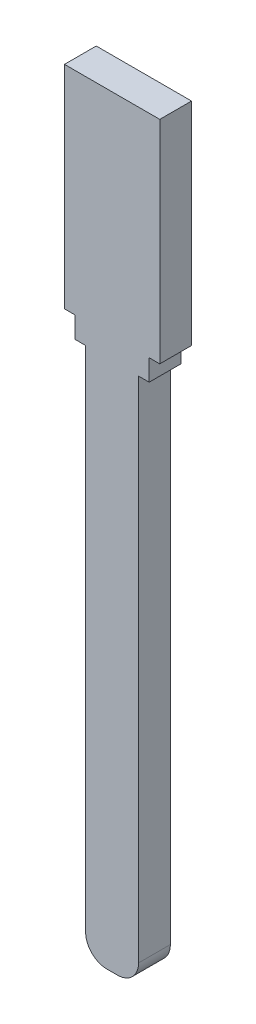
ISO-10303-21;
HEADER;
FILE_DESCRIPTION(('STEP AP214'),'2;1');
FILE_NAME('part.step','',(''),(''),'','','');
FILE_SCHEMA(('AUTOMOTIVE_DESIGN { 1 0 10303 214 1 1 1 1 }'));
ENDSEC;
DATA;
#1=APPLICATION_CONTEXT('core data for automotive mechanical design processes');
#2=APPLICATION_PROTOCOL_DEFINITION('international standard','automotive_design',2000,#1);
#3=PRODUCT_CONTEXT('',#1,'mechanical');
#4=PRODUCT('Part','Part','',(#3));
#5=PRODUCT_RELATED_PRODUCT_CATEGORY('part','',(#4));
#6=PRODUCT_DEFINITION_FORMATION('','',#4);
#7=PRODUCT_DEFINITION_CONTEXT('part definition',#1,'design');
#8=PRODUCT_DEFINITION('design','',#6,#7);
#9=PRODUCT_DEFINITION_SHAPE('','',#8);
#10=(LENGTH_UNIT() NAMED_UNIT(*) SI_UNIT(.MILLI.,.METRE.));
#11=(NAMED_UNIT(*) PLANE_ANGLE_UNIT() SI_UNIT($,.RADIAN.));
#12=(NAMED_UNIT(*) SI_UNIT($,.STERADIAN.) SOLID_ANGLE_UNIT());
#13=UNCERTAINTY_MEASURE_WITH_UNIT(LENGTH_MEASURE(1.E-05),#10,'distance_accuracy_value','');
#14=(GEOMETRIC_REPRESENTATION_CONTEXT(3) GLOBAL_UNCERTAINTY_ASSIGNED_CONTEXT((#13)) GLOBAL_UNIT_ASSIGNED_CONTEXT((#10,
#11,#12)) REPRESENTATION_CONTEXT('',''));
#15=CARTESIAN_POINT('',(0.,0.,0.));
#16=DIRECTION('',(0.,0.,1.));
#17=DIRECTION('',(1.,0.,0.));
#18=AXIS2_PLACEMENT_3D('',#15,#16,#17);
#19=CARTESIAN_POINT('',(-40.4136113676577,-48.5,3.));
#20=DIRECTION('',(0.,0.,-1.));
#21=DIRECTION('',(-1.,0.,0.));
#22=AXIS2_PLACEMENT_3D('',#19,#20,#21);
#23=CYLINDRICAL_SURFACE('',#22,2.);
#24=CARTESIAN_POINT('',(-40.4136113676577,-48.5,0.));
#25=DIRECTION('',(0.,0.,1.));
#26=DIRECTION('',(1.,0.,0.));
#27=AXIS2_PLACEMENT_3D('',#24,#25,#26);
#28=CIRCLE('',#27,2.);
#29=CARTESIAN_POINT('',(-40.4136113676577,-50.5,0.));
#30=VERTEX_POINT('',#29);
#31=CARTESIAN_POINT('',(-38.4136113676577,-48.5,0.));
#32=VERTEX_POINT('',#31);
#33=EDGE_CURVE('E165',#30,#32,#28,.T.);
#34=ORIENTED_EDGE('',*,*,#33,.T.);
#35=DIRECTION('',(0.,0.,-1.));
#36=VECTOR('',#35,1.);
#37=CARTESIAN_POINT('',(-38.4136113676577,-48.5,3.));
#38=LINE('',#37,#36);
#39=CARTESIAN_POINT('',(-38.4136113676577,-48.5,3.));
#40=VERTEX_POINT('',#39);
#41=EDGE_CURVE('E11',#40,#32,#38,.T.);
#42=ORIENTED_EDGE('',*,*,#41,.F.);
#43=CARTESIAN_POINT('',(-40.4136113676577,-48.5,3.));
#44=DIRECTION('',(0.,0.,1.));
#45=DIRECTION('',(1.,0.,0.));
#46=AXIS2_PLACEMENT_3D('',#43,#44,#45);
#47=CIRCLE('',#46,2.);
#48=CARTESIAN_POINT('',(-40.4136113676577,-50.5,3.));
#49=VERTEX_POINT('',#48);
#50=EDGE_CURVE('E192',#49,#40,#47,.T.);
#51=ORIENTED_EDGE('',*,*,#50,.F.);
#52=DIRECTION('',(0.,0.,-1.));
#53=VECTOR('',#52,1.);
#54=CARTESIAN_POINT('',(-40.4136113676577,-50.5,3.));
#55=LINE('',#54,#53);
#56=EDGE_CURVE('E161',#49,#30,#55,.T.);
#57=ORIENTED_EDGE('',*,*,#56,.T.);
#58=EDGE_LOOP('',(#34,#42,#51,#57));
#59=FACE_BOUND('',#58,.T.);
#60=ADVANCED_FACE('F33',(#59),#23,.T.);
#61=CARTESIAN_POINT('',(-38.4136113676577,-0.499999999999997,3.));
#62=DIRECTION('',(-1.,0.,0.));
#63=DIRECTION('',(0.,0.,1.));
#64=AXIS2_PLACEMENT_3D('',#61,#62,#63);
#65=PLANE('',#64);
#66=DIRECTION('',(0.,1.,0.));
#67=VECTOR('',#66,1.);
#68=CARTESIAN_POINT('',(-38.4136113676577,-0.499999999999997,0.));
#69=LINE('',#68,#67);
#70=CARTESIAN_POINT('',(-38.4136113676577,-0.499999999999997,0.));
#71=VERTEX_POINT('',#70);
#72=EDGE_CURVE('E168',#32,#71,#69,.T.);
#73=ORIENTED_EDGE('',*,*,#72,.T.);
#74=DIRECTION('',(0.,0.,-1.));
#75=VECTOR('',#74,1.);
#76=CARTESIAN_POINT('',(-38.4136113676577,-0.499999999999997,3.));
#77=LINE('',#76,#75);
#78=CARTESIAN_POINT('',(-38.4136113676577,-0.499999999999997,3.));
#79=VERTEX_POINT('',#78);
#80=EDGE_CURVE('E41',#79,#71,#77,.T.);
#81=ORIENTED_EDGE('',*,*,#80,.F.);
#82=DIRECTION('',(0.,1.,0.));
#83=VECTOR('',#82,1.);
#84=CARTESIAN_POINT('',(-38.4136113676577,-0.499999999999997,3.));
#85=LINE('',#84,#83);
#86=EDGE_CURVE('E110',#40,#79,#85,.T.);
#87=ORIENTED_EDGE('',*,*,#86,.F.);
#88=ORIENTED_EDGE('',*,*,#41,.T.);
#89=EDGE_LOOP('',(#73,#81,#87,#88));
#90=FACE_BOUND('',#89,.T.);
#91=ADVANCED_FACE('F279',(#90),#65,.F.);
#92=CARTESIAN_POINT('',(-37.4136113676577,-0.499999999999997,3.));
#93=DIRECTION('',(0.,1.,0.));
#94=DIRECTION('',(0.,0.,1.));
#95=AXIS2_PLACEMENT_3D('',#92,#93,#94);
#96=PLANE('',#95);
#97=DIRECTION('',(1.,0.,0.));
#98=VECTOR('',#97,1.);
#99=CARTESIAN_POINT('',(-37.4136113676577,-0.499999999999997,0.));
#100=LINE('',#99,#98);
#101=CARTESIAN_POINT('',(-37.4136113676577,-0.499999999999997,0.));
#102=VERTEX_POINT('',#101);
#103=EDGE_CURVE('E170',#71,#102,#100,.T.);
#104=ORIENTED_EDGE('',*,*,#103,.T.);
#105=DIRECTION('',(0.,0.,-1.));
#106=VECTOR('',#105,1.);
#107=CARTESIAN_POINT('',(-37.4136113676577,-0.499999999999997,3.));
#108=LINE('',#107,#106);
#109=CARTESIAN_POINT('',(-37.4136113676577,-0.499999999999997,3.));
#110=VERTEX_POINT('',#109);
#111=EDGE_CURVE('E217',#110,#102,#108,.T.);
#112=ORIENTED_EDGE('',*,*,#111,.F.);
#113=DIRECTION('',(1.,0.,0.));
#114=VECTOR('',#113,1.);
#115=CARTESIAN_POINT('',(-37.4136113676577,-0.499999999999997,3.));
#116=LINE('',#115,#114);
#117=EDGE_CURVE('E225',#79,#110,#116,.T.);
#118=ORIENTED_EDGE('',*,*,#117,.F.);
#119=ORIENTED_EDGE('',*,*,#80,.T.);
#120=EDGE_LOOP('',(#104,#112,#118,#119));
#121=FACE_BOUND('',#120,.T.);
#122=ADVANCED_FACE('F223',(#121),#96,.F.);
#123=CARTESIAN_POINT('',(-37.4136113676577,1.5,3.));
#124=DIRECTION('',(-1.,0.,0.));
#125=DIRECTION('',(0.,0.,1.));
#126=AXIS2_PLACEMENT_3D('',#123,#124,#125);
#127=PLANE('',#126);
#128=DIRECTION('',(0.,1.,0.));
#129=VECTOR('',#128,1.);
#130=CARTESIAN_POINT('',(-37.4136113676577,1.5,0.));
#131=LINE('',#130,#129);
#132=CARTESIAN_POINT('',(-37.4136113676577,1.5,0.));
#133=VERTEX_POINT('',#132);
#134=EDGE_CURVE('E172',#102,#133,#131,.T.);
#135=ORIENTED_EDGE('',*,*,#134,.T.);
#136=DIRECTION('',(0.,0.,-1.));
#137=VECTOR('',#136,1.);
#138=CARTESIAN_POINT('',(-37.4136113676577,1.5,3.));
#139=LINE('',#138,#137);
#140=CARTESIAN_POINT('',(-37.4136113676577,1.5,3.));
#141=VERTEX_POINT('',#140);
#142=EDGE_CURVE('E214',#141,#133,#139,.T.);
#143=ORIENTED_EDGE('',*,*,#142,.F.);
#144=DIRECTION('',(0.,1.,0.));
#145=VECTOR('',#144,1.);
#146=CARTESIAN_POINT('',(-37.4136113676577,1.5,3.));
#147=LINE('',#146,#145);
#148=EDGE_CURVE('E242',#110,#141,#147,.T.);
#149=ORIENTED_EDGE('',*,*,#148,.F.);
#150=ORIENTED_EDGE('',*,*,#111,.T.);
#151=EDGE_LOOP('',(#135,#143,#149,#150));
#152=FACE_BOUND('',#151,.T.);
#153=ADVANCED_FACE('F233',(#152),#127,.F.);
#154=CARTESIAN_POINT('',(-36.4136113676577,1.5,3.));
#155=DIRECTION('',(0.,1.,0.));
#156=DIRECTION('',(0.,0.,1.));
#157=AXIS2_PLACEMENT_3D('',#154,#155,#156);
#158=PLANE('',#157);
#159=DIRECTION('',(1.,0.,0.));
#160=VECTOR('',#159,1.);
#161=CARTESIAN_POINT('',(-36.4136113676577,1.5,0.));
#162=LINE('',#161,#160);
#163=CARTESIAN_POINT('',(-36.4136113676577,1.5,0.));
#164=VERTEX_POINT('',#163);
#165=EDGE_CURVE('E174',#133,#164,#162,.T.);
#166=ORIENTED_EDGE('',*,*,#165,.T.);
#167=DIRECTION('',(0.,0.,-1.));
#168=VECTOR('',#167,1.);
#169=CARTESIAN_POINT('',(-36.4136113676577,1.5,3.));
#170=LINE('',#169,#168);
#171=CARTESIAN_POINT('',(-36.4136113676577,1.5,3.));
#172=VERTEX_POINT('',#171);
#173=EDGE_CURVE('E211',#172,#164,#170,.T.);
#174=ORIENTED_EDGE('',*,*,#173,.F.);
#175=DIRECTION('',(1.,0.,0.));
#176=VECTOR('',#175,1.);
#177=CARTESIAN_POINT('',(-36.4136113676577,1.5,3.));
#178=LINE('',#177,#176);
#179=EDGE_CURVE('E239',#141,#172,#178,.T.);
#180=ORIENTED_EDGE('',*,*,#179,.F.);
#181=ORIENTED_EDGE('',*,*,#142,.T.);
#182=EDGE_LOOP('',(#166,#174,#180,#181));
#183=FACE_BOUND('',#182,.T.);
#184=ADVANCED_FACE('F237',(#183),#158,.F.);
#185=CARTESIAN_POINT('',(-36.4136113676577,21.5,3.));
#186=DIRECTION('',(-1.,0.,0.));
#187=DIRECTION('',(0.,0.,1.));
#188=AXIS2_PLACEMENT_3D('',#185,#186,#187);
#189=PLANE('',#188);
#190=DIRECTION('',(0.,1.,0.));
#191=VECTOR('',#190,1.);
#192=CARTESIAN_POINT('',(-36.4136113676577,21.5,0.));
#193=LINE('',#192,#191);
#194=CARTESIAN_POINT('',(-36.4136113676577,21.5,0.));
#195=VERTEX_POINT('',#194);
#196=EDGE_CURVE('E177',#164,#195,#193,.T.);
#197=ORIENTED_EDGE('',*,*,#196,.T.);
#198=DIRECTION('',(0.,0.,-1.));
#199=VECTOR('',#198,1.);
#200=CARTESIAN_POINT('',(-36.4136113676577,21.5,3.));
#201=LINE('',#200,#199);
#202=CARTESIAN_POINT('',(-36.4136113676577,21.5,3.));
#203=VERTEX_POINT('',#202);
#204=EDGE_CURVE('E208',#203,#195,#201,.T.);
#205=ORIENTED_EDGE('',*,*,#204,.F.);
#206=DIRECTION('',(0.,1.,0.));
#207=VECTOR('',#206,1.);
#208=CARTESIAN_POINT('',(-36.4136113676577,15.5,3.));
#209=LINE('',#208,#207);
#210=EDGE_CURVE('E241',#172,#203,#209,.T.);
#211=ORIENTED_EDGE('',*,*,#210,.F.);
#212=ORIENTED_EDGE('',*,*,#173,.T.);
#213=EDGE_LOOP('',(#197,#205,#211,#212));
#214=FACE_BOUND('',#213,.T.);
#215=ADVANCED_FACE('F292',(#214),#189,.F.);
#216=CARTESIAN_POINT('',(-45.4136113676577,21.5,3.));
#217=DIRECTION('',(0.,-1.,0.));
#218=DIRECTION('',(0.,0.,-1.));
#219=AXIS2_PLACEMENT_3D('',#216,#217,#218);
#220=PLANE('',#219);
#221=DIRECTION('',(-1.,0.,0.));
#222=VECTOR('',#221,1.);
#223=CARTESIAN_POINT('',(-45.4136113676577,21.5,0.));
#224=LINE('',#223,#222);
#225=CARTESIAN_POINT('',(-45.4136113676577,21.5,0.));
#226=VERTEX_POINT('',#225);
#227=EDGE_CURVE('E179',#195,#226,#224,.T.);
#228=ORIENTED_EDGE('',*,*,#227,.T.);
#229=DIRECTION('',(0.,0.,-1.));
#230=VECTOR('',#229,1.);
#231=CARTESIAN_POINT('',(-45.4136113676577,21.5,3.));
#232=LINE('',#231,#230);
#233=CARTESIAN_POINT('',(-45.4136113676577,21.5,3.));
#234=VERTEX_POINT('',#233);
#235=EDGE_CURVE('E205',#234,#226,#232,.T.);
#236=ORIENTED_EDGE('',*,*,#235,.F.);
#237=DIRECTION('',(-1.,0.,0.));
#238=VECTOR('',#237,1.);
#239=CARTESIAN_POINT('',(-45.4136113676577,21.5,3.));
#240=LINE('',#239,#238);
#241=EDGE_CURVE('E244',#203,#234,#240,.T.);
#242=ORIENTED_EDGE('',*,*,#241,.F.);
#243=ORIENTED_EDGE('',*,*,#204,.T.);
#244=EDGE_LOOP('',(#228,#236,#242,#243));
#245=FACE_BOUND('',#244,.T.);
#246=ADVANCED_FACE('F295',(#245),#220,.F.);
#247=CARTESIAN_POINT('',(-45.4136113676577,1.5,3.));
#248=DIRECTION('',(1.,0.,0.));
#249=DIRECTION('',(0.,0.,-1.));
#250=AXIS2_PLACEMENT_3D('',#247,#248,#249);
#251=PLANE('',#250);
#252=DIRECTION('',(0.,-1.,0.));
#253=VECTOR('',#252,1.);
#254=CARTESIAN_POINT('',(-45.4136113676577,1.5,0.));
#255=LINE('',#254,#253);
#256=CARTESIAN_POINT('',(-45.4136113676577,1.5,0.));
#257=VERTEX_POINT('',#256);
#258=EDGE_CURVE('E181',#226,#257,#255,.T.);
#259=ORIENTED_EDGE('',*,*,#258,.T.);
#260=DIRECTION('',(0.,0.,-1.));
#261=VECTOR('',#260,1.);
#262=CARTESIAN_POINT('',(-45.4136113676577,1.5,3.));
#263=LINE('',#262,#261);
#264=CARTESIAN_POINT('',(-45.4136113676577,1.5,3.));
#265=VERTEX_POINT('',#264);
#266=EDGE_CURVE('E202',#265,#257,#263,.T.);
#267=ORIENTED_EDGE('',*,*,#266,.F.);
#268=DIRECTION('',(0.,-1.,0.));
#269=VECTOR('',#268,1.);
#270=CARTESIAN_POINT('',(-45.4136113676577,1.5,3.));
#271=LINE('',#270,#269);
#272=EDGE_CURVE('E250',#234,#265,#271,.T.);
#273=ORIENTED_EDGE('',*,*,#272,.F.);
#274=ORIENTED_EDGE('',*,*,#235,.T.);
#275=EDGE_LOOP('',(#259,#267,#273,#274));
#276=FACE_BOUND('',#275,.T.);
#277=ADVANCED_FACE('F299',(#276),#251,.F.);
#278=CARTESIAN_POINT('',(-44.4136113676577,1.5,3.));
#279=DIRECTION('',(0.,1.,0.));
#280=DIRECTION('',(0.,0.,1.));
#281=AXIS2_PLACEMENT_3D('',#278,#279,#280);
#282=PLANE('',#281);
#283=DIRECTION('',(1.,0.,0.));
#284=VECTOR('',#283,1.);
#285=CARTESIAN_POINT('',(-44.4136113676577,1.5,0.));
#286=LINE('',#285,#284);
#287=CARTESIAN_POINT('',(-44.4136113676577,1.5,0.));
#288=VERTEX_POINT('',#287);
#289=EDGE_CURVE('E183',#257,#288,#286,.T.);
#290=ORIENTED_EDGE('',*,*,#289,.T.);
#291=DIRECTION('',(0.,0.,-1.));
#292=VECTOR('',#291,1.);
#293=CARTESIAN_POINT('',(-44.4136113676577,1.5,3.));
#294=LINE('',#293,#292);
#295=CARTESIAN_POINT('',(-44.4136113676577,1.5,3.));
#296=VERTEX_POINT('',#295);
#297=EDGE_CURVE('E199',#296,#288,#294,.T.);
#298=ORIENTED_EDGE('',*,*,#297,.F.);
#299=DIRECTION('',(1.,0.,0.));
#300=VECTOR('',#299,1.);
#301=CARTESIAN_POINT('',(-44.4136113676577,1.5,3.));
#302=LINE('',#301,#300);
#303=EDGE_CURVE('E252',#265,#296,#302,.T.);
#304=ORIENTED_EDGE('',*,*,#303,.F.);
#305=ORIENTED_EDGE('',*,*,#266,.T.);
#306=EDGE_LOOP('',(#290,#298,#304,#305));
#307=FACE_BOUND('',#306,.T.);
#308=ADVANCED_FACE('F303',(#307),#282,.F.);
#309=CARTESIAN_POINT('',(-44.4136113676577,-0.499999999999997,3.));
#310=DIRECTION('',(1.,0.,0.));
#311=DIRECTION('',(0.,0.,-1.));
#312=AXIS2_PLACEMENT_3D('',#309,#310,#311);
#313=PLANE('',#312);
#314=DIRECTION('',(0.,-1.,0.));
#315=VECTOR('',#314,1.);
#316=CARTESIAN_POINT('',(-44.4136113676577,-0.499999999999997,0.));
#317=LINE('',#316,#315);
#318=CARTESIAN_POINT('',(-44.4136113676577,-0.499999999999997,0.));
#319=VERTEX_POINT('',#318);
#320=EDGE_CURVE('E185',#288,#319,#317,.T.);
#321=ORIENTED_EDGE('',*,*,#320,.T.);
#322=DIRECTION('',(0.,0.,-1.));
#323=VECTOR('',#322,1.);
#324=CARTESIAN_POINT('',(-44.4136113676577,-0.499999999999997,3.));
#325=LINE('',#324,#323);
#326=CARTESIAN_POINT('',(-44.4136113676577,-0.499999999999997,3.));
#327=VERTEX_POINT('',#326);
#328=EDGE_CURVE('E196',#327,#319,#325,.T.);
#329=ORIENTED_EDGE('',*,*,#328,.F.);
#330=DIRECTION('',(0.,-1.,0.));
#331=VECTOR('',#330,1.);
#332=CARTESIAN_POINT('',(-44.4136113676577,-0.499999999999997,3.));
#333=LINE('',#332,#331);
#334=EDGE_CURVE('E254',#296,#327,#333,.T.);
#335=ORIENTED_EDGE('',*,*,#334,.F.);
#336=ORIENTED_EDGE('',*,*,#297,.T.);
#337=EDGE_LOOP('',(#321,#329,#335,#336));
#338=FACE_BOUND('',#337,.T.);
#339=ADVANCED_FACE('F260',(#338),#313,.F.);
#340=CARTESIAN_POINT('',(-43.4136113676577,-0.499999999999997,3.));
#341=DIRECTION('',(0.,1.,0.));
#342=DIRECTION('',(0.,0.,1.));
#343=AXIS2_PLACEMENT_3D('',#340,#341,#342);
#344=PLANE('',#343);
#345=DIRECTION('',(1.,0.,0.));
#346=VECTOR('',#345,1.);
#347=CARTESIAN_POINT('',(-43.4136113676577,-0.499999999999997,0.));
#348=LINE('',#347,#346);
#349=CARTESIAN_POINT('',(-43.4136113676577,-0.499999999999997,0.));
#350=VERTEX_POINT('',#349);
#351=EDGE_CURVE('E187',#319,#350,#348,.T.);
#352=ORIENTED_EDGE('',*,*,#351,.T.);
#353=DIRECTION('',(0.,0.,-1.));
#354=VECTOR('',#353,1.);
#355=CARTESIAN_POINT('',(-43.4136113676577,-0.499999999999997,3.));
#356=LINE('',#355,#354);
#357=CARTESIAN_POINT('',(-43.4136113676577,-0.499999999999997,3.));
#358=VERTEX_POINT('',#357);
#359=EDGE_CURVE('E156',#358,#350,#356,.T.);
#360=ORIENTED_EDGE('',*,*,#359,.F.);
#361=DIRECTION('',(1.,0.,0.));
#362=VECTOR('',#361,1.);
#363=CARTESIAN_POINT('',(-43.4136113676577,-0.499999999999997,3.));
#364=LINE('',#363,#362);
#365=EDGE_CURVE('E147',#327,#358,#364,.T.);
#366=ORIENTED_EDGE('',*,*,#365,.F.);
#367=ORIENTED_EDGE('',*,*,#328,.T.);
#368=EDGE_LOOP('',(#352,#360,#366,#367));
#369=FACE_BOUND('',#368,.T.);
#370=ADVANCED_FACE('F264',(#369),#344,.F.);
#371=CARTESIAN_POINT('',(-43.4136113676577,-48.5,3.));
#372=DIRECTION('',(1.,0.,0.));
#373=DIRECTION('',(0.,1.,0.));
#374=AXIS2_PLACEMENT_3D('',#371,#372,#373);
#375=PLANE('',#374);
#376=DIRECTION('',(0.,-1.,0.));
#377=VECTOR('',#376,1.);
#378=CARTESIAN_POINT('',(-43.4136113676577,-48.5,0.));
#379=LINE('',#378,#377);
#380=CARTESIAN_POINT('',(-43.4136113676577,-48.5,0.));
#381=VERTEX_POINT('',#380);
#382=EDGE_CURVE('E155',#350,#381,#379,.T.);
#383=ORIENTED_EDGE('',*,*,#382,.T.);
#384=DIRECTION('',(0.,0.,-1.));
#385=VECTOR('',#384,1.);
#386=CARTESIAN_POINT('',(-43.4136113676577,-48.5,3.));
#387=LINE('',#386,#385);
#388=CARTESIAN_POINT('',(-43.4136113676577,-48.5,3.));
#389=VERTEX_POINT('',#388);
#390=EDGE_CURVE('E152',#389,#381,#387,.T.);
#391=ORIENTED_EDGE('',*,*,#390,.F.);
#392=DIRECTION('',(0.,-1.,0.));
#393=VECTOR('',#392,1.);
#394=CARTESIAN_POINT('',(-43.4136113676577,-48.5,3.));
#395=LINE('',#394,#393);
#396=EDGE_CURVE('E141',#358,#389,#395,.T.);
#397=ORIENTED_EDGE('',*,*,#396,.F.);
#398=ORIENTED_EDGE('',*,*,#359,.T.);
#399=EDGE_LOOP('',(#383,#391,#397,#398));
#400=FACE_BOUND('',#399,.T.);
#401=ADVANCED_FACE('F153',(#400),#375,.F.);
#402=CARTESIAN_POINT('',(-41.4136113676577,-48.5,3.));
#403=DIRECTION('',(0.,0.,-1.));
#404=DIRECTION('',(-1.,0.,0.));
#405=AXIS2_PLACEMENT_3D('',#402,#403,#404);
#406=CYLINDRICAL_SURFACE('',#405,2.);
#407=CARTESIAN_POINT('',(-41.4136113676577,-48.5,0.));
#408=DIRECTION('',(0.,0.,1.));
#409=DIRECTION('',(1.,0.,0.));
#410=AXIS2_PLACEMENT_3D('',#407,#408,#409);
#411=CIRCLE('',#410,2.);
#412=CARTESIAN_POINT('',(-41.4136113676577,-50.5,0.));
#413=VERTEX_POINT('',#412);
#414=EDGE_CURVE('E96',#381,#413,#411,.T.);
#415=ORIENTED_EDGE('',*,*,#414,.T.);
#416=DIRECTION('',(0.,0.,-1.));
#417=VECTOR('',#416,1.);
#418=CARTESIAN_POINT('',(-41.4136113676577,-50.5,3.));
#419=LINE('',#418,#417);
#420=CARTESIAN_POINT('',(-41.4136113676577,-50.5,3.));
#421=VERTEX_POINT('',#420);
#422=EDGE_CURVE('E157',#421,#413,#419,.T.);
#423=ORIENTED_EDGE('',*,*,#422,.F.);
#424=CARTESIAN_POINT('',(-41.4136113676577,-48.5,3.));
#425=DIRECTION('',(0.,0.,1.));
#426=DIRECTION('',(1.,0.,0.));
#427=AXIS2_PLACEMENT_3D('',#424,#425,#426);
#428=CIRCLE('',#427,2.);
#429=EDGE_CURVE('E145',#389,#421,#428,.T.);
#430=ORIENTED_EDGE('',*,*,#429,.F.);
#431=ORIENTED_EDGE('',*,*,#390,.T.);
#432=EDGE_LOOP('',(#415,#423,#430,#431));
#433=FACE_BOUND('',#432,.T.);
#434=ADVANCED_FACE('F159',(#433),#406,.T.);
#435=CARTESIAN_POINT('',(-40.4136113676577,-50.5,3.));
#436=DIRECTION('',(0.,1.,0.));
#437=DIRECTION('',(0.,0.,1.));
#438=AXIS2_PLACEMENT_3D('',#435,#436,#437);
#439=PLANE('',#438);
#440=DIRECTION('',(1.,0.,0.));
#441=VECTOR('',#440,1.);
#442=CARTESIAN_POINT('',(-40.4136113676577,-50.5,0.));
#443=LINE('',#442,#441);
#444=EDGE_CURVE('E102',#413,#30,#443,.T.);
#445=ORIENTED_EDGE('',*,*,#444,.T.);
#446=ORIENTED_EDGE('',*,*,#56,.F.);
#447=DIRECTION('',(1.,0.,0.));
#448=VECTOR('',#447,1.);
#449=CARTESIAN_POINT('',(-40.4136113676577,-50.5,3.));
#450=LINE('',#449,#448);
#451=EDGE_CURVE('E49',#421,#49,#450,.T.);
#452=ORIENTED_EDGE('',*,*,#451,.F.);
#453=ORIENTED_EDGE('',*,*,#422,.T.);
#454=EDGE_LOOP('',(#445,#446,#452,#453));
#455=FACE_BOUND('',#454,.T.);
#456=ADVANCED_FACE('F268',(#455),#439,.F.);
#457=CARTESIAN_POINT('',(-40.4136113676577,-48.5,3.));
#458=DIRECTION('',(0.,0.,1.));
#459=DIRECTION('',(1.,0.,0.));
#460=AXIS2_PLACEMENT_3D('',#457,#458,#459);
#461=PLANE('',#460);
#462=ORIENTED_EDGE('',*,*,#50,.T.);
#463=ORIENTED_EDGE('',*,*,#86,.T.);
#464=ORIENTED_EDGE('',*,*,#117,.T.);
#465=ORIENTED_EDGE('',*,*,#148,.T.);
#466=ORIENTED_EDGE('',*,*,#179,.T.);
#467=ORIENTED_EDGE('',*,*,#210,.T.);
#468=ORIENTED_EDGE('',*,*,#241,.T.);
#469=ORIENTED_EDGE('',*,*,#272,.T.);
#470=ORIENTED_EDGE('',*,*,#303,.T.);
#471=ORIENTED_EDGE('',*,*,#334,.T.);
#472=ORIENTED_EDGE('',*,*,#365,.T.);
#473=ORIENTED_EDGE('',*,*,#396,.T.);
#474=ORIENTED_EDGE('',*,*,#429,.T.);
#475=ORIENTED_EDGE('',*,*,#451,.T.);
#476=EDGE_LOOP('',(#462,#463,#464,#465,#466,#467,#468,#469,#470,#471,#472,#473,#474,#475));
#477=FACE_BOUND('',#476,.T.);
#478=ADVANCED_FACE('F143',(#477),#461,.T.);
#479=CARTESIAN_POINT('',(-40.4136113676577,-48.5,0.));
#480=DIRECTION('',(0.,0.,1.));
#481=DIRECTION('',(1.,0.,0.));
#482=AXIS2_PLACEMENT_3D('',#479,#480,#481);
#483=PLANE('',#482);
#484=ORIENTED_EDGE('',*,*,#33,.F.);
#485=ORIENTED_EDGE('',*,*,#444,.F.);
#486=ORIENTED_EDGE('',*,*,#414,.F.);
#487=ORIENTED_EDGE('',*,*,#382,.F.);
#488=ORIENTED_EDGE('',*,*,#351,.F.);
#489=ORIENTED_EDGE('',*,*,#320,.F.);
#490=ORIENTED_EDGE('',*,*,#289,.F.);
#491=ORIENTED_EDGE('',*,*,#258,.F.);
#492=ORIENTED_EDGE('',*,*,#227,.F.);
#493=ORIENTED_EDGE('',*,*,#196,.F.);
#494=ORIENTED_EDGE('',*,*,#165,.F.);
#495=ORIENTED_EDGE('',*,*,#134,.F.);
#496=ORIENTED_EDGE('',*,*,#103,.F.);
#497=ORIENTED_EDGE('',*,*,#72,.F.);
#498=EDGE_LOOP('',(#484,#485,#486,#487,#488,#489,#490,#491,#492,#493,#494,#495,#496,#497));
#499=FACE_BOUND('',#498,.T.);
#500=ADVANCED_FACE('F229',(#499),#483,.F.);
#501=CLOSED_SHELL('',(#60,#91,#122,#153,#184,#215,#246,#277,#308,#339,#370,#401,#434,#456,#478,#500));
#502=MANIFOLD_SOLID_BREP('B2',#501);
#503=ADVANCED_BREP_SHAPE_REPRESENTATION('',(#18,#502),#14);
#504=SHAPE_DEFINITION_REPRESENTATION(#9,#503);
ENDSEC;
END-ISO-10303-21;
